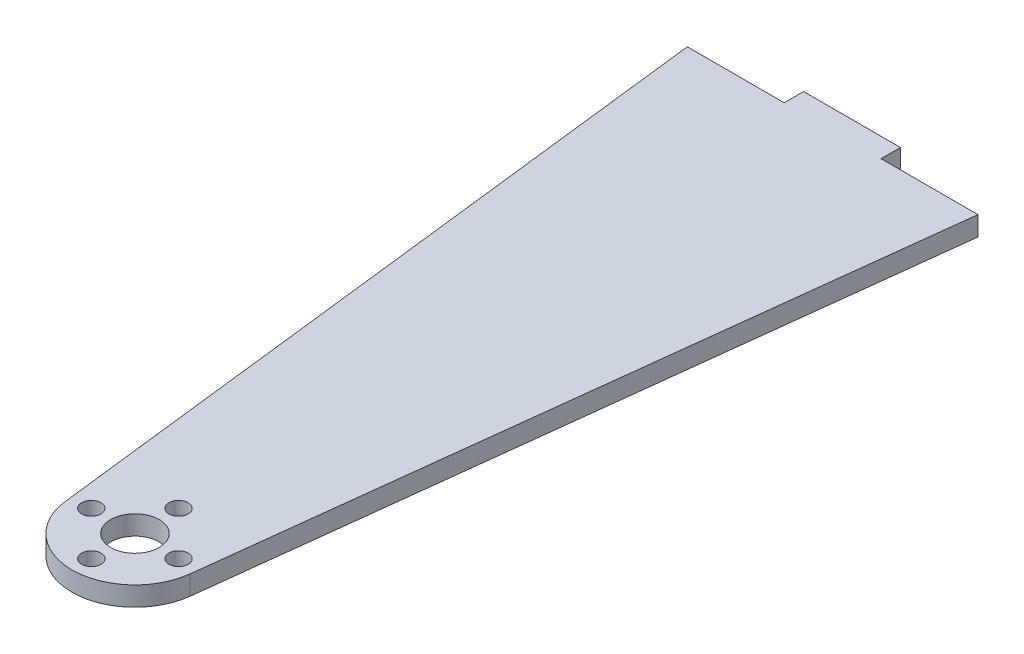
ISO-10303-21;
HEADER;
FILE_DESCRIPTION(('STEP AP214'),'2;1');
FILE_NAME('part.step','',(''),(''),'','','');
FILE_SCHEMA(('AUTOMOTIVE_DESIGN { 1 0 10303 214 1 1 1 1 }'));
ENDSEC;
DATA;
#1=APPLICATION_CONTEXT('core data for automotive mechanical design processes');
#2=APPLICATION_PROTOCOL_DEFINITION('international standard','automotive_design',2000,#1);
#3=PRODUCT_CONTEXT('',#1,'mechanical');
#4=PRODUCT('Part','Part','',(#3));
#5=PRODUCT_RELATED_PRODUCT_CATEGORY('part','',(#4));
#6=PRODUCT_DEFINITION_FORMATION('','',#4);
#7=PRODUCT_DEFINITION_CONTEXT('part definition',#1,'design');
#8=PRODUCT_DEFINITION('design','',#6,#7);
#9=PRODUCT_DEFINITION_SHAPE('','',#8);
#10=(LENGTH_UNIT() NAMED_UNIT(*) SI_UNIT(.MILLI.,.METRE.));
#11=(NAMED_UNIT(*) PLANE_ANGLE_UNIT() SI_UNIT($,.RADIAN.));
#12=(NAMED_UNIT(*) SI_UNIT($,.STERADIAN.) SOLID_ANGLE_UNIT());
#13=UNCERTAINTY_MEASURE_WITH_UNIT(LENGTH_MEASURE(1.E-05),#10,'distance_accuracy_value','');
#14=(GEOMETRIC_REPRESENTATION_CONTEXT(3) GLOBAL_UNCERTAINTY_ASSIGNED_CONTEXT((#13)) GLOBAL_UNIT_ASSIGNED_CONTEXT((#10,
#11,#12)) REPRESENTATION_CONTEXT('',''));
#15=CARTESIAN_POINT('',(0.,0.,0.));
#16=DIRECTION('',(0.,0.,1.));
#17=DIRECTION('',(1.,0.,0.));
#18=AXIS2_PLACEMENT_3D('',#15,#16,#17);
#19=CARTESIAN_POINT('',(0.,76.2000000000036,228.6));
#20=DIRECTION('',(0.,1.,0.));
#21=DIRECTION('',(0.,0.,1.));
#22=AXIS2_PLACEMENT_3D('',#19,#20,#21);
#23=PLANE('',#22);
#24=CARTESIAN_POINT('',(0.,76.2000000000036,242.8875));
#25=DIRECTION('',(0.,1.,0.));
#26=DIRECTION('',(0.,0.,1.));
#27=AXIS2_PLACEMENT_3D('',#24,#25,#26);
#28=CIRCLE('',#27,3.175);
#29=CARTESIAN_POINT('',(0.,76.2000000000036,246.0625));
#30=VERTEX_POINT('',#29);
#31=EDGE_CURVE('E200',#30,#30,#28,.T.);
#32=ORIENTED_EDGE('',*,*,#31,.F.);
#33=EDGE_LOOP('',(#32));
#34=FACE_BOUND('',#33,.T.);
#35=CARTESIAN_POINT('',(0.,76.2000000000036,214.3125));
#36=DIRECTION('',(0.,1.,0.));
#37=DIRECTION('',(0.,0.,1.));
#38=AXIS2_PLACEMENT_3D('',#35,#36,#37);
#39=CIRCLE('',#38,3.175);
#40=CARTESIAN_POINT('',(0.,76.2000000000036,217.4875));
#41=VERTEX_POINT('',#40);
#42=EDGE_CURVE('E188',#41,#41,#39,.T.);
#43=ORIENTED_EDGE('',*,*,#42,.F.);
#44=EDGE_LOOP('',(#43));
#45=FACE_BOUND('',#44,.T.);
#46=DIRECTION('',(0.,0.,1.));
#47=VECTOR('',#46,1.);
#48=CARTESIAN_POINT('',(-15.8749999999998,76.2000000000036,-6.35));
#49=LINE('',#48,#47);
#50=CARTESIAN_POINT('',(-15.8749999999998,76.2000000000036,-6.35));
#51=VERTEX_POINT('',#50);
#52=CARTESIAN_POINT('',(-15.875,76.2000000000036,0.));
#53=VERTEX_POINT('',#52);
#54=EDGE_CURVE('E151',#51,#53,#49,.T.);
#55=ORIENTED_EDGE('',*,*,#54,.T.);
#56=DIRECTION('',(-1.,0.,0.));
#57=VECTOR('',#56,1.);
#58=CARTESIAN_POINT('',(-15.875,76.2000000000036,0.));
#59=LINE('',#58,#57);
#60=CARTESIAN_POINT('',(-47.625,76.2000000000036,0.));
#61=VERTEX_POINT('',#60);
#62=EDGE_CURVE('E99',#53,#61,#59,.T.);
#63=ORIENTED_EDGE('',*,*,#62,.T.);
#64=DIRECTION('',(0.116633680958419,0.,0.993175001933743));
#65=VECTOR('',#64,1.);
#66=CARTESIAN_POINT('',(-47.625,76.2000000000036,0.));
#67=LINE('',#66,#65);
#68=CARTESIAN_POINT('',(-20.4966491024076,76.2000000000036,231.007027590779));
#69=VERTEX_POINT('',#68);
#70=EDGE_CURVE('E166',#61,#69,#67,.T.);
#71=ORIENTED_EDGE('',*,*,#70,.T.);
#72=CARTESIAN_POINT('',(0.,76.2000000000036,228.6));
#73=DIRECTION('',(0.,1.,0.));
#74=DIRECTION('',(0.,0.,1.));
#75=AXIS2_PLACEMENT_3D('',#72,#73,#74);
#76=CIRCLE('',#75,20.6375);
#77=CARTESIAN_POINT('',(20.4966491024076,76.2000000000036,231.007027590779));
#78=VERTEX_POINT('',#77);
#79=EDGE_CURVE('E179',#69,#78,#76,.T.);
#80=ORIENTED_EDGE('',*,*,#79,.T.);
#81=DIRECTION('',(0.116633680958419,0.,-0.993175001933743));
#82=VECTOR('',#81,1.);
#83=CARTESIAN_POINT('',(47.625,76.2000000000036,0.));
#84=LINE('',#83,#82);
#85=CARTESIAN_POINT('',(47.625,76.2000000000036,0.));
#86=VERTEX_POINT('',#85);
#87=EDGE_CURVE('E118',#78,#86,#84,.T.);
#88=ORIENTED_EDGE('',*,*,#87,.T.);
#89=DIRECTION('',(-1.,0.,0.));
#90=VECTOR('',#89,1.);
#91=CARTESIAN_POINT('',(47.625,76.2000000000036,0.));
#92=LINE('',#91,#90);
#93=CARTESIAN_POINT('',(15.8750000000002,76.2000000000036,0.));
#94=VERTEX_POINT('',#93);
#95=EDGE_CURVE('E112',#86,#94,#92,.T.);
#96=ORIENTED_EDGE('',*,*,#95,.T.);
#97=DIRECTION('',(0.,0.,-1.));
#98=VECTOR('',#97,1.);
#99=CARTESIAN_POINT('',(15.8750000000002,76.2000000000036,-6.35));
#100=LINE('',#99,#98);
#101=CARTESIAN_POINT('',(15.8750000000002,76.2000000000036,-6.35));
#102=VERTEX_POINT('',#101);
#103=EDGE_CURVE('E116',#94,#102,#100,.T.);
#104=ORIENTED_EDGE('',*,*,#103,.T.);
#105=DIRECTION('',(-1.,0.,0.));
#106=VECTOR('',#105,1.);
#107=CARTESIAN_POINT('',(-15.8749999999998,76.2000000000036,-6.35));
#108=LINE('',#107,#106);
#109=EDGE_CURVE('E56',#102,#51,#108,.T.);
#110=ORIENTED_EDGE('',*,*,#109,.T.);
#111=EDGE_LOOP('',(#55,#63,#71,#80,#88,#96,#104,#110));
#112=FACE_BOUND('',#111,.T.);
#113=CARTESIAN_POINT('',(0.,76.2000000000036,228.6));
#114=DIRECTION('',(0.,1.,0.));
#115=DIRECTION('',(0.,0.,1.));
#116=AXIS2_PLACEMENT_3D('',#113,#114,#115);
#117=CIRCLE('',#116,7.93749999999998);
#118=CARTESIAN_POINT('',(0.,76.2000000000036,236.5375));
#119=VERTEX_POINT('',#118);
#120=EDGE_CURVE('E140',#119,#119,#117,.T.);
#121=ORIENTED_EDGE('',*,*,#120,.F.);
#122=EDGE_LOOP('',(#121));
#123=FACE_BOUND('',#122,.T.);
#124=CARTESIAN_POINT('',(14.2875,76.2000000000036,228.6));
#125=DIRECTION('',(0.,1.,0.));
#126=DIRECTION('',(0.,0.,1.));
#127=AXIS2_PLACEMENT_3D('',#124,#125,#126);
#128=CIRCLE('',#127,3.17499999999999);
#129=CARTESIAN_POINT('',(14.2875,76.2000000000036,231.775));
#130=VERTEX_POINT('',#129);
#131=EDGE_CURVE('E194',#130,#130,#128,.T.);
#132=ORIENTED_EDGE('',*,*,#131,.F.);
#133=EDGE_LOOP('',(#132));
#134=FACE_BOUND('',#133,.T.);
#135=CARTESIAN_POINT('',(-14.2875,76.2000000000036,228.6));
#136=DIRECTION('',(0.,1.,0.));
#137=DIRECTION('',(0.,0.,1.));
#138=AXIS2_PLACEMENT_3D('',#135,#136,#137);
#139=CIRCLE('',#138,3.17500000000001);
#140=CARTESIAN_POINT('',(-14.2875,76.2000000000036,231.775));
#141=VERTEX_POINT('',#140);
#142=EDGE_CURVE('E206',#141,#141,#139,.T.);
#143=ORIENTED_EDGE('',*,*,#142,.F.);
#144=EDGE_LOOP('',(#143));
#145=FACE_BOUND('',#144,.T.);
#146=ADVANCED_FACE('F39',(#34,#45,#112,#123,#134,#145),#23,.T.);
#147=CARTESIAN_POINT('',(0.,69.8500000000036,228.6));
#148=DIRECTION('',(0.,1.,0.));
#149=DIRECTION('',(0.,0.,1.));
#150=AXIS2_PLACEMENT_3D('',#147,#148,#149);
#151=PLANE('',#150);
#152=DIRECTION('',(0.,0.,1.));
#153=VECTOR('',#152,1.);
#154=CARTESIAN_POINT('',(-15.8749999999998,69.8500000000036,-6.35));
#155=LINE('',#154,#153);
#156=CARTESIAN_POINT('',(-15.8749999999998,69.8500000000036,-6.35));
#157=VERTEX_POINT('',#156);
#158=CARTESIAN_POINT('',(-15.875,69.8500000000036,0.));
#159=VERTEX_POINT('',#158);
#160=EDGE_CURVE('E136',#157,#159,#155,.T.);
#161=ORIENTED_EDGE('',*,*,#160,.F.);
#162=DIRECTION('',(-1.,0.,0.));
#163=VECTOR('',#162,1.);
#164=CARTESIAN_POINT('',(-15.8749999999998,69.8500000000036,-6.35));
#165=LINE('',#164,#163);
#166=CARTESIAN_POINT('',(15.8750000000002,69.8500000000036,-6.35));
#167=VERTEX_POINT('',#166);
#168=EDGE_CURVE('E91',#167,#157,#165,.T.);
#169=ORIENTED_EDGE('',*,*,#168,.F.);
#170=DIRECTION('',(0.,0.,-1.));
#171=VECTOR('',#170,1.);
#172=CARTESIAN_POINT('',(15.8750000000002,69.8500000000036,-6.35));
#173=LINE('',#172,#171);
#174=CARTESIAN_POINT('',(15.8750000000002,69.8500000000036,0.));
#175=VERTEX_POINT('',#174);
#176=EDGE_CURVE('E85',#175,#167,#173,.T.);
#177=ORIENTED_EDGE('',*,*,#176,.F.);
#178=DIRECTION('',(-1.,0.,0.));
#179=VECTOR('',#178,1.);
#180=CARTESIAN_POINT('',(47.625,69.8500000000036,0.));
#181=LINE('',#180,#179);
#182=CARTESIAN_POINT('',(47.625,69.8500000000036,0.));
#183=VERTEX_POINT('',#182);
#184=EDGE_CURVE('E126',#183,#175,#181,.T.);
#185=ORIENTED_EDGE('',*,*,#184,.F.);
#186=DIRECTION('',(0.116633680958419,0.,-0.993175001933743));
#187=VECTOR('',#186,1.);
#188=CARTESIAN_POINT('',(47.625,69.8500000000036,0.));
#189=LINE('',#188,#187);
#190=CARTESIAN_POINT('',(20.4966491024076,69.8500000000036,231.007027590779));
#191=VERTEX_POINT('',#190);
#192=EDGE_CURVE('E146',#191,#183,#189,.T.);
#193=ORIENTED_EDGE('',*,*,#192,.F.);
#194=CARTESIAN_POINT('',(0.,69.8500000000036,228.6));
#195=DIRECTION('',(0.,1.,0.));
#196=DIRECTION('',(0.,0.,1.));
#197=AXIS2_PLACEMENT_3D('',#194,#195,#196);
#198=CIRCLE('',#197,20.6375);
#199=CARTESIAN_POINT('',(-20.4966491024076,69.8500000000036,231.007027590779));
#200=VERTEX_POINT('',#199);
#201=EDGE_CURVE('E144',#200,#191,#198,.T.);
#202=ORIENTED_EDGE('',*,*,#201,.F.);
#203=DIRECTION('',(0.116633680958419,0.,0.993175001933743));
#204=VECTOR('',#203,1.);
#205=CARTESIAN_POINT('',(-47.625,69.8500000000036,0.));
#206=LINE('',#205,#204);
#207=CARTESIAN_POINT('',(-47.625,69.8500000000036,0.));
#208=VERTEX_POINT('',#207);
#209=EDGE_CURVE('E142',#208,#200,#206,.T.);
#210=ORIENTED_EDGE('',*,*,#209,.F.);
#211=DIRECTION('',(-1.,0.,0.));
#212=VECTOR('',#211,1.);
#213=CARTESIAN_POINT('',(-15.875,69.8500000000036,0.));
#214=LINE('',#213,#212);
#215=EDGE_CURVE('E139',#159,#208,#214,.T.);
#216=ORIENTED_EDGE('',*,*,#215,.F.);
#217=EDGE_LOOP('',(#161,#169,#177,#185,#193,#202,#210,#216));
#218=FACE_BOUND('',#217,.T.);
#219=CARTESIAN_POINT('',(0.,69.8500000000036,228.6));
#220=DIRECTION('',(0.,1.,0.));
#221=DIRECTION('',(0.,0.,1.));
#222=AXIS2_PLACEMENT_3D('',#219,#220,#221);
#223=CIRCLE('',#222,7.93749999999998);
#224=CARTESIAN_POINT('',(0.,69.8500000000036,236.5375));
#225=VERTEX_POINT('',#224);
#226=EDGE_CURVE('E185',#225,#225,#223,.T.);
#227=ORIENTED_EDGE('',*,*,#226,.T.);
#228=EDGE_LOOP('',(#227));
#229=FACE_BOUND('',#228,.T.);
#230=CARTESIAN_POINT('',(0.,69.8500000000036,214.3125));
#231=DIRECTION('',(0.,1.,0.));
#232=DIRECTION('',(0.,0.,1.));
#233=AXIS2_PLACEMENT_3D('',#230,#231,#232);
#234=CIRCLE('',#233,3.175);
#235=CARTESIAN_POINT('',(0.,69.8500000000036,217.4875));
#236=VERTEX_POINT('',#235);
#237=EDGE_CURVE('E191',#236,#236,#234,.T.);
#238=ORIENTED_EDGE('',*,*,#237,.T.);
#239=EDGE_LOOP('',(#238));
#240=FACE_BOUND('',#239,.T.);
#241=CARTESIAN_POINT('',(14.2875,69.8500000000036,228.6));
#242=DIRECTION('',(0.,1.,0.));
#243=DIRECTION('',(0.,0.,1.));
#244=AXIS2_PLACEMENT_3D('',#241,#242,#243);
#245=CIRCLE('',#244,3.17499999999999);
#246=CARTESIAN_POINT('',(14.2875,69.8500000000036,231.775));
#247=VERTEX_POINT('',#246);
#248=EDGE_CURVE('E197',#247,#247,#245,.T.);
#249=ORIENTED_EDGE('',*,*,#248,.T.);
#250=EDGE_LOOP('',(#249));
#251=FACE_BOUND('',#250,.T.);
#252=CARTESIAN_POINT('',(0.,69.8500000000036,242.8875));
#253=DIRECTION('',(0.,1.,0.));
#254=DIRECTION('',(0.,0.,1.));
#255=AXIS2_PLACEMENT_3D('',#252,#253,#254);
#256=CIRCLE('',#255,3.175);
#257=CARTESIAN_POINT('',(0.,69.8500000000036,246.0625));
#258=VERTEX_POINT('',#257);
#259=EDGE_CURVE('E203',#258,#258,#256,.T.);
#260=ORIENTED_EDGE('',*,*,#259,.T.);
#261=EDGE_LOOP('',(#260));
#262=FACE_BOUND('',#261,.T.);
#263=CARTESIAN_POINT('',(-14.2875,69.8500000000036,228.6));
#264=DIRECTION('',(0.,1.,0.));
#265=DIRECTION('',(0.,0.,1.));
#266=AXIS2_PLACEMENT_3D('',#263,#264,#265);
#267=CIRCLE('',#266,3.17500000000001);
#268=CARTESIAN_POINT('',(-14.2875,69.8500000000036,231.775));
#269=VERTEX_POINT('',#268);
#270=EDGE_CURVE('E209',#269,#269,#267,.T.);
#271=ORIENTED_EDGE('',*,*,#270,.T.);
#272=EDGE_LOOP('',(#271));
#273=FACE_BOUND('',#272,.T.);
#274=ADVANCED_FACE('F170',(#218,#229,#240,#251,#262,#273),#151,.F.);
#275=CARTESIAN_POINT('',(-15.8749999999998,76.2000000000036,-6.35));
#276=DIRECTION('',(1.,0.,0.));
#277=DIRECTION('',(0.,0.,-1.));
#278=AXIS2_PLACEMENT_3D('',#275,#276,#277);
#279=PLANE('',#278);
#280=ORIENTED_EDGE('',*,*,#160,.T.);
#281=DIRECTION('',(0.,-1.,0.));
#282=VECTOR('',#281,1.);
#283=CARTESIAN_POINT('',(-15.875,76.2000000000036,0.));
#284=LINE('',#283,#282);
#285=EDGE_CURVE('E11',#53,#159,#284,.T.);
#286=ORIENTED_EDGE('',*,*,#285,.F.);
#287=ORIENTED_EDGE('',*,*,#54,.F.);
#288=DIRECTION('',(0.,-1.,0.));
#289=VECTOR('',#288,1.);
#290=CARTESIAN_POINT('',(-15.8749999999998,76.2000000000036,-6.35));
#291=LINE('',#290,#289);
#292=EDGE_CURVE('E132',#51,#157,#291,.T.);
#293=ORIENTED_EDGE('',*,*,#292,.T.);
#294=EDGE_LOOP('',(#280,#286,#287,#293));
#295=FACE_BOUND('',#294,.T.);
#296=ADVANCED_FACE('F41',(#295),#279,.F.);
#297=CARTESIAN_POINT('',(-15.875,76.2000000000036,0.));
#298=DIRECTION('',(0.,0.,1.));
#299=DIRECTION('',(1.,0.,0.));
#300=AXIS2_PLACEMENT_3D('',#297,#298,#299);
#301=PLANE('',#300);
#302=ORIENTED_EDGE('',*,*,#215,.T.);
#303=DIRECTION('',(0.,-1.,0.));
#304=VECTOR('',#303,1.);
#305=CARTESIAN_POINT('',(-47.625,76.2000000000036,0.));
#306=LINE('',#305,#304);
#307=EDGE_CURVE('E48',#61,#208,#306,.T.);
#308=ORIENTED_EDGE('',*,*,#307,.F.);
#309=ORIENTED_EDGE('',*,*,#62,.F.);
#310=ORIENTED_EDGE('',*,*,#285,.T.);
#311=EDGE_LOOP('',(#302,#308,#309,#310));
#312=FACE_BOUND('',#311,.T.);
#313=ADVANCED_FACE('F243',(#312),#301,.F.);
#314=CARTESIAN_POINT('',(-47.625,76.2000000000036,0.));
#315=DIRECTION('',(0.993175001933743,0.,-0.116633680958419));
#316=DIRECTION('',(-0.116633680958419,0.,-0.993175001933743));
#317=AXIS2_PLACEMENT_3D('',#314,#315,#316);
#318=PLANE('',#317);
#319=ORIENTED_EDGE('',*,*,#209,.T.);
#320=DIRECTION('',(0.,-1.,0.));
#321=VECTOR('',#320,1.);
#322=CARTESIAN_POINT('',(-20.4966491024076,76.2000000000036,231.007027590779));
#323=LINE('',#322,#321);
#324=EDGE_CURVE('E158',#69,#200,#323,.T.);
#325=ORIENTED_EDGE('',*,*,#324,.F.);
#326=ORIENTED_EDGE('',*,*,#70,.F.);
#327=ORIENTED_EDGE('',*,*,#307,.T.);
#328=EDGE_LOOP('',(#319,#325,#326,#327));
#329=FACE_BOUND('',#328,.T.);
#330=ADVANCED_FACE('F164',(#329),#318,.F.);
#331=CARTESIAN_POINT('',(0.,76.2000000000036,228.6));
#332=DIRECTION('',(0.,-1.,0.));
#333=DIRECTION('',(0.,0.,-1.));
#334=AXIS2_PLACEMENT_3D('',#331,#332,#333);
#335=CYLINDRICAL_SURFACE('',#334,20.6375);
#336=ORIENTED_EDGE('',*,*,#201,.T.);
#337=DIRECTION('',(0.,-1.,0.));
#338=VECTOR('',#337,1.);
#339=CARTESIAN_POINT('',(20.4966491024076,76.2000000000036,231.007027590779));
#340=LINE('',#339,#338);
#341=EDGE_CURVE('E155',#78,#191,#340,.T.);
#342=ORIENTED_EDGE('',*,*,#341,.F.);
#343=ORIENTED_EDGE('',*,*,#79,.F.);
#344=ORIENTED_EDGE('',*,*,#324,.T.);
#345=EDGE_LOOP('',(#336,#342,#343,#344));
#346=FACE_BOUND('',#345,.T.);
#347=ADVANCED_FACE('F175',(#346),#335,.T.);
#348=CARTESIAN_POINT('',(47.625,76.2000000000036,0.));
#349=DIRECTION('',(-0.993175001933743,0.,-0.116633680958419));
#350=DIRECTION('',(-0.116633680958419,0.,0.993175001933743));
#351=AXIS2_PLACEMENT_3D('',#348,#349,#350);
#352=PLANE('',#351);
#353=ORIENTED_EDGE('',*,*,#192,.T.);
#354=DIRECTION('',(0.,-1.,0.));
#355=VECTOR('',#354,1.);
#356=CARTESIAN_POINT('',(47.625,76.2000000000036,0.));
#357=LINE('',#356,#355);
#358=EDGE_CURVE('E127',#86,#183,#357,.T.);
#359=ORIENTED_EDGE('',*,*,#358,.F.);
#360=ORIENTED_EDGE('',*,*,#87,.F.);
#361=ORIENTED_EDGE('',*,*,#341,.T.);
#362=EDGE_LOOP('',(#353,#359,#360,#361));
#363=FACE_BOUND('',#362,.T.);
#364=ADVANCED_FACE('F178',(#363),#352,.F.);
#365=CARTESIAN_POINT('',(47.625,76.2000000000036,0.));
#366=DIRECTION('',(0.,0.,1.));
#367=DIRECTION('',(1.,0.,0.));
#368=AXIS2_PLACEMENT_3D('',#365,#366,#367);
#369=PLANE('',#368);
#370=ORIENTED_EDGE('',*,*,#184,.T.);
#371=DIRECTION('',(0.,-1.,0.));
#372=VECTOR('',#371,1.);
#373=CARTESIAN_POINT('',(15.8750000000002,76.2000000000036,0.));
#374=LINE('',#373,#372);
#375=EDGE_CURVE('E123',#94,#175,#374,.T.);
#376=ORIENTED_EDGE('',*,*,#375,.F.);
#377=ORIENTED_EDGE('',*,*,#95,.F.);
#378=ORIENTED_EDGE('',*,*,#358,.T.);
#379=EDGE_LOOP('',(#370,#376,#377,#378));
#380=FACE_BOUND('',#379,.T.);
#381=ADVANCED_FACE('F124',(#380),#369,.F.);
#382=CARTESIAN_POINT('',(15.8750000000002,76.2000000000036,-6.35));
#383=DIRECTION('',(-1.,0.,0.));
#384=DIRECTION('',(0.,0.,1.));
#385=AXIS2_PLACEMENT_3D('',#382,#383,#384);
#386=PLANE('',#385);
#387=ORIENTED_EDGE('',*,*,#176,.T.);
#388=DIRECTION('',(0.,-1.,0.));
#389=VECTOR('',#388,1.);
#390=CARTESIAN_POINT('',(15.8750000000002,76.2000000000036,-6.35));
#391=LINE('',#390,#389);
#392=EDGE_CURVE('E128',#102,#167,#391,.T.);
#393=ORIENTED_EDGE('',*,*,#392,.F.);
#394=ORIENTED_EDGE('',*,*,#103,.F.);
#395=ORIENTED_EDGE('',*,*,#375,.T.);
#396=EDGE_LOOP('',(#387,#393,#394,#395));
#397=FACE_BOUND('',#396,.T.);
#398=ADVANCED_FACE('F130',(#397),#386,.F.);
#399=CARTESIAN_POINT('',(-15.8749999999998,76.2000000000036,-6.35));
#400=DIRECTION('',(0.,0.,1.));
#401=DIRECTION('',(1.,0.,0.));
#402=AXIS2_PLACEMENT_3D('',#399,#400,#401);
#403=PLANE('',#402);
#404=ORIENTED_EDGE('',*,*,#168,.T.);
#405=ORIENTED_EDGE('',*,*,#292,.F.);
#406=ORIENTED_EDGE('',*,*,#109,.F.);
#407=ORIENTED_EDGE('',*,*,#392,.T.);
#408=EDGE_LOOP('',(#404,#405,#406,#407));
#409=FACE_BOUND('',#408,.T.);
#410=ADVANCED_FACE('F231',(#409),#403,.F.);
#411=CARTESIAN_POINT('',(0.,76.2000000000036,228.6));
#412=DIRECTION('',(0.,-1.,0.));
#413=DIRECTION('',(0.,0.,-1.));
#414=AXIS2_PLACEMENT_3D('',#411,#412,#413);
#415=CYLINDRICAL_SURFACE('',#414,7.93749999999998);
#416=ORIENTED_EDGE('',*,*,#120,.T.);
#417=EDGE_LOOP('',(#416));
#418=FACE_BOUND('',#417,.T.);
#419=ORIENTED_EDGE('',*,*,#226,.F.);
#420=EDGE_LOOP('',(#419));
#421=FACE_BOUND('',#420,.T.);
#422=ADVANCED_FACE('F228',(#418,#421),#415,.F.);
#423=CARTESIAN_POINT('',(0.,76.2000000000036,214.3125));
#424=DIRECTION('',(0.,-1.,0.));
#425=DIRECTION('',(0.,0.,-1.));
#426=AXIS2_PLACEMENT_3D('',#423,#424,#425);
#427=CYLINDRICAL_SURFACE('',#426,3.175);
#428=ORIENTED_EDGE('',*,*,#42,.T.);
#429=EDGE_LOOP('',(#428));
#430=FACE_BOUND('',#429,.T.);
#431=ORIENTED_EDGE('',*,*,#237,.F.);
#432=EDGE_LOOP('',(#431));
#433=FACE_BOUND('',#432,.T.);
#434=ADVANCED_FACE('F319',(#430,#433),#427,.F.);
#435=CARTESIAN_POINT('',(14.2875,76.2000000000036,228.6));
#436=DIRECTION('',(0.,-1.,0.));
#437=DIRECTION('',(0.,0.,-1.));
#438=AXIS2_PLACEMENT_3D('',#435,#436,#437);
#439=CYLINDRICAL_SURFACE('',#438,3.17499999999999);
#440=ORIENTED_EDGE('',*,*,#131,.T.);
#441=EDGE_LOOP('',(#440));
#442=FACE_BOUND('',#441,.T.);
#443=ORIENTED_EDGE('',*,*,#248,.F.);
#444=EDGE_LOOP('',(#443));
#445=FACE_BOUND('',#444,.T.);
#446=ADVANCED_FACE('F328',(#442,#445),#439,.F.);
#447=CARTESIAN_POINT('',(0.,76.2000000000036,242.8875));
#448=DIRECTION('',(0.,-1.,0.));
#449=DIRECTION('',(0.,0.,-1.));
#450=AXIS2_PLACEMENT_3D('',#447,#448,#449);
#451=CYLINDRICAL_SURFACE('',#450,3.175);
#452=ORIENTED_EDGE('',*,*,#31,.T.);
#453=EDGE_LOOP('',(#452));
#454=FACE_BOUND('',#453,.T.);
#455=ORIENTED_EDGE('',*,*,#259,.F.);
#456=EDGE_LOOP('',(#455));
#457=FACE_BOUND('',#456,.T.);
#458=ADVANCED_FACE('F337',(#454,#457),#451,.F.);
#459=CARTESIAN_POINT('',(-14.2875,76.2000000000036,228.6));
#460=DIRECTION('',(0.,-1.,0.));
#461=DIRECTION('',(0.,0.,-1.));
#462=AXIS2_PLACEMENT_3D('',#459,#460,#461);
#463=CYLINDRICAL_SURFACE('',#462,3.17500000000001);
#464=ORIENTED_EDGE('',*,*,#142,.T.);
#465=EDGE_LOOP('',(#464));
#466=FACE_BOUND('',#465,.T.);
#467=ORIENTED_EDGE('',*,*,#270,.F.);
#468=EDGE_LOOP('',(#467));
#469=FACE_BOUND('',#468,.T.);
#470=ADVANCED_FACE('F215',(#466,#469),#463,.F.);
#471=CLOSED_SHELL('',(#146,#274,#296,#313,#330,#347,#364,#381,#398,#410,#422,#434,#446,#458,#470));
#472=MANIFOLD_SOLID_BREP('B2',#471);
#473=ADVANCED_BREP_SHAPE_REPRESENTATION('',(#18,#472),#14);
#474=SHAPE_DEFINITION_REPRESENTATION(#9,#473);
ENDSEC;
END-ISO-10303-21;
